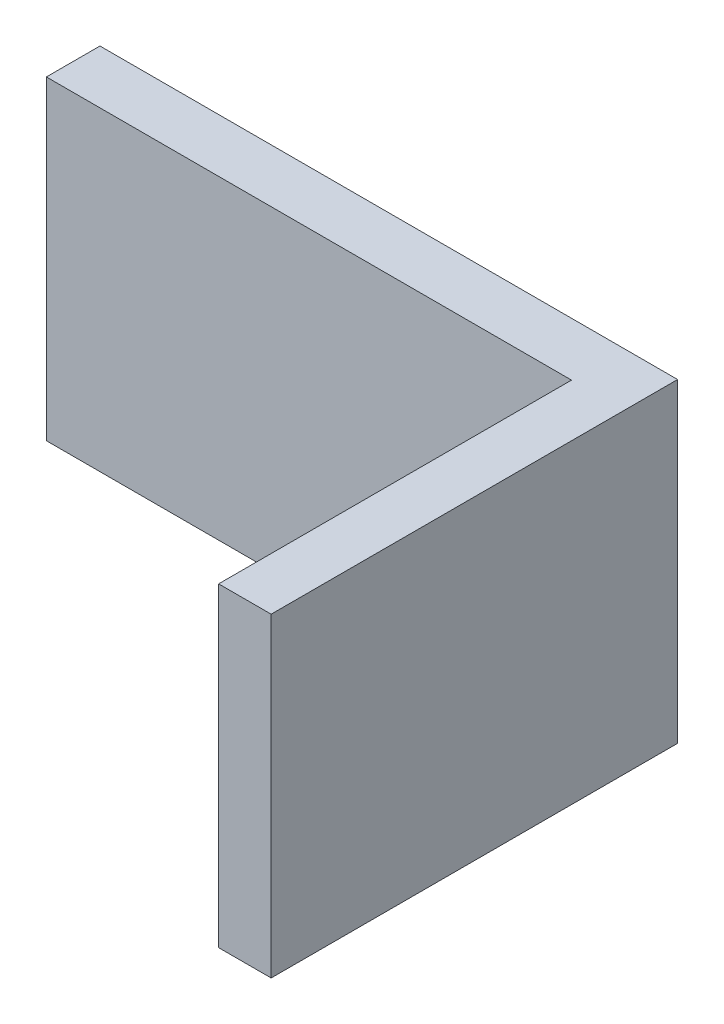
ISO-10303-21;
HEADER;
FILE_DESCRIPTION(('STEP AP214'),'2;1');
FILE_NAME('part.step','',(''),(''),'','','');
FILE_SCHEMA(('AUTOMOTIVE_DESIGN { 1 0 10303 214 1 1 1 1 }'));
ENDSEC;
DATA;
#1=APPLICATION_CONTEXT('core data for automotive mechanical design processes');
#2=APPLICATION_PROTOCOL_DEFINITION('international standard','automotive_design',2000,#1);
#3=PRODUCT_CONTEXT('',#1,'mechanical');
#4=PRODUCT('Part','Part','',(#3));
#5=PRODUCT_RELATED_PRODUCT_CATEGORY('part','',(#4));
#6=PRODUCT_DEFINITION_FORMATION('','',#4);
#7=PRODUCT_DEFINITION_CONTEXT('part definition',#1,'design');
#8=PRODUCT_DEFINITION('design','',#6,#7);
#9=PRODUCT_DEFINITION_SHAPE('','',#8);
#10=(LENGTH_UNIT() NAMED_UNIT(*) SI_UNIT(.MILLI.,.METRE.));
#11=(NAMED_UNIT(*) PLANE_ANGLE_UNIT() SI_UNIT($,.RADIAN.));
#12=(NAMED_UNIT(*) SI_UNIT($,.STERADIAN.) SOLID_ANGLE_UNIT());
#13=UNCERTAINTY_MEASURE_WITH_UNIT(LENGTH_MEASURE(1.E-05),#10,'distance_accuracy_value','');
#14=(GEOMETRIC_REPRESENTATION_CONTEXT(3) GLOBAL_UNCERTAINTY_ASSIGNED_CONTEXT((#13)) GLOBAL_UNIT_ASSIGNED_CONTEXT((#10,
#11,#12)) REPRESENTATION_CONTEXT('',''));
#15=CARTESIAN_POINT('',(0.,0.,0.));
#16=DIRECTION('',(0.,0.,1.));
#17=DIRECTION('',(1.,0.,0.));
#18=AXIS2_PLACEMENT_3D('',#15,#16,#17);
#19=CARTESIAN_POINT('',(4.55,3.4,0.));
#20=DIRECTION('',(0.,1.,0.));
#21=DIRECTION('',(0.,0.,1.));
#22=AXIS2_PLACEMENT_3D('',#19,#20,#21);
#23=PLANE('',#22);
#24=DIRECTION('',(1.,0.,0.));
#25=VECTOR('',#24,1.);
#26=CARTESIAN_POINT('',(4.,3.4,0.));
#27=LINE('',#26,#25);
#28=CARTESIAN_POINT('',(4.,3.4,0.));
#29=VERTEX_POINT('',#28);
#30=CARTESIAN_POINT('',(4.55,3.4,0.));
#31=VERTEX_POINT('',#30);
#32=EDGE_CURVE('E11',#29,#31,#27,.T.);
#33=ORIENTED_EDGE('',*,*,#32,.F.);
#34=DIRECTION('',(0.,0.,-1.));
#35=VECTOR('',#34,1.);
#36=CARTESIAN_POINT('',(4.,3.4,0.051));
#37=LINE('',#36,#35);
#38=CARTESIAN_POINT('',(4.,3.4,0.051));
#39=VERTEX_POINT('',#38);
#40=EDGE_CURVE('E24',#39,#29,#37,.T.);
#41=ORIENTED_EDGE('',*,*,#40,.F.);
#42=DIRECTION('',(-1.,0.,0.));
#43=VECTOR('',#42,1.);
#44=CARTESIAN_POINT('',(4.5,3.4,0.051));
#45=LINE('',#44,#43);
#46=CARTESIAN_POINT('',(4.5,3.4,0.051));
#47=VERTEX_POINT('',#46);
#48=EDGE_CURVE('E87',#47,#39,#45,.T.);
#49=ORIENTED_EDGE('',*,*,#48,.F.);
#50=DIRECTION('',(0.,0.,-1.));
#51=VECTOR('',#50,1.);
#52=CARTESIAN_POINT('',(4.5,3.4,0.387));
#53=LINE('',#52,#51);
#54=CARTESIAN_POINT('',(4.5,3.4,0.387));
#55=VERTEX_POINT('',#54);
#56=EDGE_CURVE('E114',#55,#47,#53,.T.);
#57=ORIENTED_EDGE('',*,*,#56,.F.);
#58=DIRECTION('',(-1.,0.,0.));
#59=VECTOR('',#58,1.);
#60=CARTESIAN_POINT('',(4.55,3.4,0.387));
#61=LINE('',#60,#59);
#62=CARTESIAN_POINT('',(4.55,3.4,0.387));
#63=VERTEX_POINT('',#62);
#64=EDGE_CURVE('E111',#63,#55,#61,.T.);
#65=ORIENTED_EDGE('',*,*,#64,.F.);
#66=DIRECTION('',(0.,0.,1.));
#67=VECTOR('',#66,1.);
#68=CARTESIAN_POINT('',(4.55,3.4,0.));
#69=LINE('',#68,#67);
#70=EDGE_CURVE('E108',#31,#63,#69,.T.);
#71=ORIENTED_EDGE('',*,*,#70,.F.);
#72=EDGE_LOOP('',(#33,#41,#49,#57,#65,#71));
#73=FACE_BOUND('',#72,.T.);
#74=ADVANCED_FACE('F17',(#73),#23,.T.);
#75=CARTESIAN_POINT('',(4.,3.1,0.));
#76=DIRECTION('',(0.,-1.,0.));
#77=DIRECTION('',(0.,0.,1.));
#78=AXIS2_PLACEMENT_3D('',#75,#76,#77);
#79=PLANE('',#78);
#80=DIRECTION('',(-1.,0.,0.));
#81=VECTOR('',#80,1.);
#82=CARTESIAN_POINT('',(4.55,3.1,0.));
#83=LINE('',#82,#81);
#84=CARTESIAN_POINT('',(4.55,3.1,0.));
#85=VERTEX_POINT('',#84);
#86=CARTESIAN_POINT('',(4.,3.1,0.));
#87=VERTEX_POINT('',#86);
#88=EDGE_CURVE('E106',#85,#87,#83,.T.);
#89=ORIENTED_EDGE('',*,*,#88,.F.);
#90=DIRECTION('',(0.,0.,-1.));
#91=VECTOR('',#90,1.);
#92=CARTESIAN_POINT('',(4.55,3.1,0.387));
#93=LINE('',#92,#91);
#94=CARTESIAN_POINT('',(4.55,3.1,0.387));
#95=VERTEX_POINT('',#94);
#96=EDGE_CURVE('E103',#95,#85,#93,.T.);
#97=ORIENTED_EDGE('',*,*,#96,.F.);
#98=DIRECTION('',(1.,0.,0.));
#99=VECTOR('',#98,1.);
#100=CARTESIAN_POINT('',(4.5,3.1,0.387));
#101=LINE('',#100,#99);
#102=CARTESIAN_POINT('',(4.5,3.1,0.387));
#103=VERTEX_POINT('',#102);
#104=EDGE_CURVE('E100',#103,#95,#101,.T.);
#105=ORIENTED_EDGE('',*,*,#104,.F.);
#106=DIRECTION('',(0.,0.,1.));
#107=VECTOR('',#106,1.);
#108=CARTESIAN_POINT('',(4.5,3.1,0.051));
#109=LINE('',#108,#107);
#110=CARTESIAN_POINT('',(4.5,3.1,0.051));
#111=VERTEX_POINT('',#110);
#112=EDGE_CURVE('E72',#111,#103,#109,.T.);
#113=ORIENTED_EDGE('',*,*,#112,.F.);
#114=DIRECTION('',(1.,0.,0.));
#115=VECTOR('',#114,1.);
#116=CARTESIAN_POINT('',(4.,3.1,0.051));
#117=LINE('',#116,#115);
#118=CARTESIAN_POINT('',(4.,3.1,0.051));
#119=VERTEX_POINT('',#118);
#120=EDGE_CURVE('E66',#119,#111,#117,.T.);
#121=ORIENTED_EDGE('',*,*,#120,.F.);
#122=DIRECTION('',(0.,0.,1.));
#123=VECTOR('',#122,1.);
#124=CARTESIAN_POINT('',(4.,3.1,0.));
#125=LINE('',#124,#123);
#126=EDGE_CURVE('E69',#87,#119,#125,.T.);
#127=ORIENTED_EDGE('',*,*,#126,.F.);
#128=EDGE_LOOP('',(#89,#97,#105,#113,#121,#127));
#129=FACE_BOUND('',#128,.T.);
#130=ADVANCED_FACE('F68',(#129),#79,.T.);
#131=CARTESIAN_POINT('',(4.55,3.4,0.387));
#132=DIRECTION('',(0.,0.,1.));
#133=DIRECTION('',(0.,1.,0.));
#134=AXIS2_PLACEMENT_3D('',#131,#132,#133);
#135=PLANE('',#134);
#136=ORIENTED_EDGE('',*,*,#64,.T.);
#137=DIRECTION('',(0.,1.,0.));
#138=VECTOR('',#137,1.);
#139=CARTESIAN_POINT('',(4.5,3.1,0.387));
#140=LINE('',#139,#138);
#141=EDGE_CURVE('E83',#103,#55,#140,.T.);
#142=ORIENTED_EDGE('',*,*,#141,.F.);
#143=ORIENTED_EDGE('',*,*,#104,.T.);
#144=DIRECTION('',(0.,-1.,0.));
#145=VECTOR('',#144,1.);
#146=CARTESIAN_POINT('',(4.55,3.4,0.387));
#147=LINE('',#146,#145);
#148=EDGE_CURVE('E88',#63,#95,#147,.T.);
#149=ORIENTED_EDGE('',*,*,#148,.F.);
#150=EDGE_LOOP('',(#136,#142,#143,#149));
#151=FACE_BOUND('',#150,.T.);
#152=ADVANCED_FACE('F125',(#151),#135,.T.);
#153=CARTESIAN_POINT('',(4.5,3.4,0.051));
#154=DIRECTION('',(0.,0.,1.));
#155=DIRECTION('',(0.,1.,0.));
#156=AXIS2_PLACEMENT_3D('',#153,#154,#155);
#157=PLANE('',#156);
#158=ORIENTED_EDGE('',*,*,#48,.T.);
#159=DIRECTION('',(0.,1.,0.));
#160=VECTOR('',#159,1.);
#161=CARTESIAN_POINT('',(4.,3.1,0.051));
#162=LINE('',#161,#160);
#163=EDGE_CURVE('E81',#119,#39,#162,.T.);
#164=ORIENTED_EDGE('',*,*,#163,.F.);
#165=ORIENTED_EDGE('',*,*,#120,.T.);
#166=DIRECTION('',(0.,-1.,0.));
#167=VECTOR('',#166,1.);
#168=CARTESIAN_POINT('',(4.5,3.4,0.051));
#169=LINE('',#168,#167);
#170=EDGE_CURVE('E89',#47,#111,#169,.T.);
#171=ORIENTED_EDGE('',*,*,#170,.F.);
#172=EDGE_LOOP('',(#158,#164,#165,#171));
#173=FACE_BOUND('',#172,.T.);
#174=ADVANCED_FACE('F86',(#173),#157,.T.);
#175=CARTESIAN_POINT('',(4.55,3.1,0.));
#176=DIRECTION('',(1.,0.,0.));
#177=DIRECTION('',(0.,0.,1.));
#178=AXIS2_PLACEMENT_3D('',#175,#176,#177);
#179=PLANE('',#178);
#180=DIRECTION('',(0.,-1.,0.));
#181=VECTOR('',#180,1.);
#182=CARTESIAN_POINT('',(4.55,3.4,0.));
#183=LINE('',#182,#181);
#184=EDGE_CURVE('E93',#31,#85,#183,.T.);
#185=ORIENTED_EDGE('',*,*,#184,.F.);
#186=ORIENTED_EDGE('',*,*,#70,.T.);
#187=ORIENTED_EDGE('',*,*,#148,.T.);
#188=ORIENTED_EDGE('',*,*,#96,.T.);
#189=EDGE_LOOP('',(#185,#186,#187,#188));
#190=FACE_BOUND('',#189,.T.);
#191=ADVANCED_FACE('F121',(#190),#179,.T.);
#192=CARTESIAN_POINT('',(4.,3.4,0.));
#193=DIRECTION('',(-1.,0.,0.));
#194=DIRECTION('',(0.,0.,1.));
#195=AXIS2_PLACEMENT_3D('',#192,#193,#194);
#196=PLANE('',#195);
#197=DIRECTION('',(0.,1.,0.));
#198=VECTOR('',#197,1.);
#199=CARTESIAN_POINT('',(4.,3.1,0.));
#200=LINE('',#199,#198);
#201=EDGE_CURVE('E82',#87,#29,#200,.T.);
#202=ORIENTED_EDGE('',*,*,#201,.F.);
#203=ORIENTED_EDGE('',*,*,#126,.T.);
#204=ORIENTED_EDGE('',*,*,#163,.T.);
#205=ORIENTED_EDGE('',*,*,#40,.T.);
#206=EDGE_LOOP('',(#202,#203,#204,#205));
#207=FACE_BOUND('',#206,.T.);
#208=ADVANCED_FACE('F80',(#207),#196,.T.);
#209=CARTESIAN_POINT('',(4.5,3.4,0.051));
#210=DIRECTION('',(-1.,0.,0.));
#211=DIRECTION('',(0.,0.,1.));
#212=AXIS2_PLACEMENT_3D('',#209,#210,#211);
#213=PLANE('',#212);
#214=ORIENTED_EDGE('',*,*,#170,.T.);
#215=ORIENTED_EDGE('',*,*,#112,.T.);
#216=ORIENTED_EDGE('',*,*,#141,.T.);
#217=ORIENTED_EDGE('',*,*,#56,.T.);
#218=EDGE_LOOP('',(#214,#215,#216,#217));
#219=FACE_BOUND('',#218,.T.);
#220=ADVANCED_FACE('F127',(#219),#213,.T.);
#221=CARTESIAN_POINT('',(4.55,3.1,0.));
#222=DIRECTION('',(0.,0.,-1.));
#223=DIRECTION('',(0.,1.,0.));
#224=AXIS2_PLACEMENT_3D('',#221,#222,#223);
#225=PLANE('',#224);
#226=ORIENTED_EDGE('',*,*,#88,.T.);
#227=ORIENTED_EDGE('',*,*,#201,.T.);
#228=ORIENTED_EDGE('',*,*,#32,.T.);
#229=ORIENTED_EDGE('',*,*,#184,.T.);
#230=EDGE_LOOP('',(#226,#227,#228,#229));
#231=FACE_BOUND('',#230,.T.);
#232=ADVANCED_FACE('F117',(#231),#225,.T.);
#233=CLOSED_SHELL('',(#74,#130,#152,#174,#191,#208,#220,#232));
#234=MANIFOLD_SOLID_BREP('B1',#233);
#235=ADVANCED_BREP_SHAPE_REPRESENTATION('',(#18,#234),#14);
#236=SHAPE_DEFINITION_REPRESENTATION(#9,#235);
ENDSEC;
END-ISO-10303-21;
